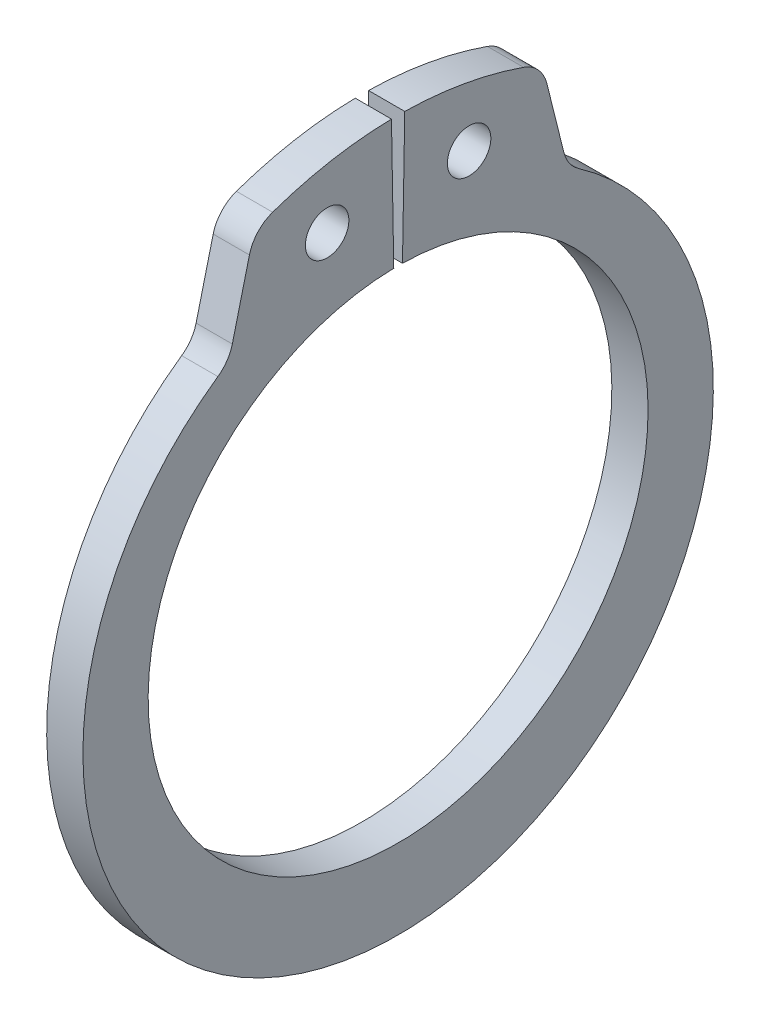
ISO-10303-21;
HEADER;
FILE_DESCRIPTION(('STEP AP214'),'2;1');
FILE_NAME('part.step','',(''),(''),'','','');
FILE_SCHEMA(('AUTOMOTIVE_DESIGN { 1 0 10303 214 1 1 1 1 }'));
ENDSEC;
DATA;
#1=APPLICATION_CONTEXT('core data for automotive mechanical design processes');
#2=APPLICATION_PROTOCOL_DEFINITION('international standard','automotive_design',2000,#1);
#3=PRODUCT_CONTEXT('',#1,'mechanical');
#4=PRODUCT('Part','Part','',(#3));
#5=PRODUCT_RELATED_PRODUCT_CATEGORY('part','',(#4));
#6=PRODUCT_DEFINITION_FORMATION('','',#4);
#7=PRODUCT_DEFINITION_CONTEXT('part definition',#1,'design');
#8=PRODUCT_DEFINITION('design','',#6,#7);
#9=PRODUCT_DEFINITION_SHAPE('','',#8);
#10=(LENGTH_UNIT() NAMED_UNIT(*) SI_UNIT(.MILLI.,.METRE.));
#11=(NAMED_UNIT(*) PLANE_ANGLE_UNIT() SI_UNIT($,.RADIAN.));
#12=(NAMED_UNIT(*) SI_UNIT($,.STERADIAN.) SOLID_ANGLE_UNIT());
#13=UNCERTAINTY_MEASURE_WITH_UNIT(LENGTH_MEASURE(1.E-05),#10,'distance_accuracy_value','');
#14=(GEOMETRIC_REPRESENTATION_CONTEXT(3) GLOBAL_UNCERTAINTY_ASSIGNED_CONTEXT((#13)) GLOBAL_UNIT_ASSIGNED_CONTEXT((#10,
#11,#12)) REPRESENTATION_CONTEXT('',''));
#15=CARTESIAN_POINT('',(0.,0.,0.));
#16=DIRECTION('',(0.,0.,1.));
#17=DIRECTION('',(1.,0.,0.));
#18=AXIS2_PLACEMENT_3D('',#15,#16,#17);
#19=CARTESIAN_POINT('',(0.5,0.,0.));
#20=DIRECTION('',(1.,0.,0.));
#21=DIRECTION('',(0.,0.,-1.));
#22=AXIS2_PLACEMENT_3D('',#19,#20,#21);
#23=PLANE('',#22);
#24=CARTESIAN_POINT('',(0.5,8.66711980549086,-1.9596288316201));
#25=DIRECTION('',(-1.,0.,0.));
#26=DIRECTION('',(0.,0.,1.));
#27=AXIS2_PLACEMENT_3D('',#24,#25,#26);
#28=CIRCLE('',#27,0.6);
#29=CARTESIAN_POINT('',(0.5,8.66711980549086,-1.3596288316201));
#30=VERTEX_POINT('',#29);
#31=EDGE_CURVE('E142',#30,#30,#28,.T.);
#32=ORIENTED_EDGE('',*,*,#31,.T.);
#33=EDGE_LOOP('',(#32));
#34=FACE_BOUND('',#33,.T.);
#35=CARTESIAN_POINT('',(0.5,0.,0.));
#36=DIRECTION('',(-1.,0.,0.));
#37=DIRECTION('',(0.,0.,1.));
#38=AXIS2_PLACEMENT_3D('',#35,#36,#37);
#39=CIRCLE('',#38,6.9);
#40=CARTESIAN_POINT('',(0.5,6.8989490965791,-0.120421604417256));
#41=VERTEX_POINT('',#40);
#42=CARTESIAN_POINT('',(0.5,6.8989490965791,0.120421604417256));
#43=VERTEX_POINT('',#42);
#44=EDGE_CURVE('E219',#41,#43,#39,.T.);
#45=ORIENTED_EDGE('',*,*,#44,.T.);
#46=DIRECTION('',(0.,-0.999847695156391,-0.0174524064372835));
#47=VECTOR('',#46,1.);
#48=CARTESIAN_POINT('',(0.5,6.8989490965791,0.120421604417256));
#49=LINE('',#48,#47);
#50=CARTESIAN_POINT('',(0.5,10.4984007991421,0.183250267591477));
#51=VERTEX_POINT('',#50);
#52=EDGE_CURVE('E157',#43,#51,#49,.F.);
#53=ORIENTED_EDGE('',*,*,#52,.T.);
#54=CARTESIAN_POINT('',(0.5,0.,0.));
#55=DIRECTION('',(-1.,0.,0.));
#56=DIRECTION('',(0.,0.,1.));
#57=AXIS2_PLACEMENT_3D('',#54,#55,#56);
#58=CIRCLE('',#57,10.5);
#59=CARTESIAN_POINT('',(0.5,9.91217887924345,3.46391539531209));
#60=VERTEX_POINT('',#59);
#61=EDGE_CURVE('E161',#60,#51,#58,.T.);
#62=ORIENTED_EDGE('',*,*,#61,.F.);
#63=CARTESIAN_POINT('',(0.5,8.96816184312502,3.13401869099666));
#64=DIRECTION('',(-1.,0.,0.));
#65=DIRECTION('',(0.,0.,1.));
#66=AXIS2_PLACEMENT_3D('',#63,#64,#65);
#67=CIRCLE('',#66,1.);
#68=CARTESIAN_POINT('',(0.5,9.21008373872469,4.10431441727265));
#69=VERTEX_POINT('',#68);
#70=EDGE_CURVE('E146',#69,#60,#67,.T.);
#71=ORIENTED_EDGE('',*,*,#70,.F.);
#72=DIRECTION('',(0.,0.970295726275997,-0.241921895599665));
#73=VECTOR('',#72,1.);
#74=CARTESIAN_POINT('',(0.5,9.71734472745919,3.97784004803122));
#75=LINE('',#74,#73);
#76=CARTESIAN_POINT('',(0.5,7.31761530924591,4.57615979123836));
#77=VERTEX_POINT('',#76);
#78=EDGE_CURVE('E140',#69,#77,#75,.F.);
#79=ORIENTED_EDGE('',*,*,#78,.T.);
#80=CARTESIAN_POINT('',(0.5,7.55953720484558,5.54645551751436));
#81=DIRECTION('',(-1.,0.,0.));
#82=DIRECTION('',(0.,0.,1.));
#83=AXIS2_PLACEMENT_3D('',#80,#81,#82);
#84=CIRCLE('',#83,1.);
#85=CARTESIAN_POINT('',(0.5,6.73911195964233,4.97470170945253));
#86=VERTEX_POINT('',#85);
#87=EDGE_CURVE('E130',#77,#86,#84,.T.);
#88=ORIENTED_EDGE('',*,*,#87,.T.);
#89=CARTESIAN_POINT('',(0.5,-0.399224177769538,0.));
#90=DIRECTION('',(-1.,0.,0.));
#91=DIRECTION('',(0.,0.,1.));
#92=AXIS2_PLACEMENT_3D('',#89,#90,#91);
#93=CIRCLE('',#92,8.70077582223046);
#94=CARTESIAN_POINT('',(0.5,6.73911195964233,-4.97470170945253));
#95=VERTEX_POINT('',#94);
#96=EDGE_CURVE('E233',#95,#86,#93,.T.);
#97=ORIENTED_EDGE('',*,*,#96,.F.);
#98=CARTESIAN_POINT('',(0.5,7.55953720484558,-5.54645551751436));
#99=DIRECTION('',(-1.,0.,0.));
#100=DIRECTION('',(0.,0.,1.));
#101=AXIS2_PLACEMENT_3D('',#98,#99,#100);
#102=CIRCLE('',#101,1.);
#103=CARTESIAN_POINT('',(0.5,7.31761530924591,-4.57615979123836));
#104=VERTEX_POINT('',#103);
#105=EDGE_CURVE('E229',#95,#104,#102,.T.);
#106=ORIENTED_EDGE('',*,*,#105,.T.);
#107=DIRECTION('',(0.,-0.970295726275997,-0.241921895599666));
#108=VECTOR('',#107,1.);
#109=CARTESIAN_POINT('',(0.5,9.71734472745919,-3.97784004803122));
#110=LINE('',#109,#108);
#111=CARTESIAN_POINT('',(0.5,9.21008373872469,-4.10431441727265));
#112=VERTEX_POINT('',#111);
#113=EDGE_CURVE('E169',#104,#112,#110,.F.);
#114=ORIENTED_EDGE('',*,*,#113,.T.);
#115=CARTESIAN_POINT('',(0.5,8.96816184312502,-3.13401869099666));
#116=DIRECTION('',(-1.,0.,0.));
#117=DIRECTION('',(0.,0.,1.));
#118=AXIS2_PLACEMENT_3D('',#115,#116,#117);
#119=CIRCLE('',#118,1.);
#120=CARTESIAN_POINT('',(0.5,9.91217887924345,-3.46391539531209));
#121=VERTEX_POINT('',#120);
#122=EDGE_CURVE('E172',#121,#112,#119,.T.);
#123=ORIENTED_EDGE('',*,*,#122,.F.);
#124=CARTESIAN_POINT('',(0.5,0.,0.));
#125=DIRECTION('',(-1.,0.,0.));
#126=DIRECTION('',(0.,0.,1.));
#127=AXIS2_PLACEMENT_3D('',#124,#125,#126);
#128=CIRCLE('',#127,10.5);
#129=CARTESIAN_POINT('',(0.5,10.4984007991421,-0.183250267591479));
#130=VERTEX_POINT('',#129);
#131=EDGE_CURVE('E222',#130,#121,#128,.T.);
#132=ORIENTED_EDGE('',*,*,#131,.F.);
#133=DIRECTION('',(0.,0.999847695156391,-0.0174524064372841));
#134=VECTOR('',#133,1.);
#135=CARTESIAN_POINT('',(0.5,10.4984007991421,-0.183250267591479));
#136=LINE('',#135,#134);
#137=EDGE_CURVE('E163',#130,#41,#136,.F.);
#138=ORIENTED_EDGE('',*,*,#137,.T.);
#139=EDGE_LOOP('',(#45,#53,#62,#71,#79,#88,#97,#106,#114,#123,#132,#138));
#140=FACE_BOUND('',#139,.T.);
#141=CARTESIAN_POINT('',(0.5,8.66711980549086,1.9596288316201));
#142=DIRECTION('',(-1.,0.,0.));
#143=DIRECTION('',(0.,0.,1.));
#144=AXIS2_PLACEMENT_3D('',#141,#142,#143);
#145=CIRCLE('',#144,0.6);
#146=CARTESIAN_POINT('',(0.5,8.66711980549086,2.5596288316201));
#147=VERTEX_POINT('',#146);
#148=EDGE_CURVE('E19',#147,#147,#145,.T.);
#149=ORIENTED_EDGE('',*,*,#148,.T.);
#150=EDGE_LOOP('',(#149));
#151=FACE_BOUND('',#150,.T.);
#152=ADVANCED_FACE('F16',(#34,#140,#151),#23,.T.);
#153=CARTESIAN_POINT('',(0.5,8.66711980549086,1.9596288316201));
#154=DIRECTION('',(-1.,0.,0.));
#155=DIRECTION('',(0.,0.,1.));
#156=AXIS2_PLACEMENT_3D('',#153,#154,#155);
#157=CYLINDRICAL_SURFACE('',#156,0.6);
#158=CARTESIAN_POINT('',(-0.5,8.66711980549086,1.9596288316201));
#159=DIRECTION('',(-1.,0.,0.));
#160=DIRECTION('',(0.,0.,1.));
#161=AXIS2_PLACEMENT_3D('',#158,#159,#160);
#162=CIRCLE('',#161,0.6);
#163=CARTESIAN_POINT('',(-0.5,8.66711980549086,2.5596288316201));
#164=VERTEX_POINT('',#163);
#165=EDGE_CURVE('E207',#164,#164,#162,.T.);
#166=ORIENTED_EDGE('',*,*,#165,.T.);
#167=EDGE_LOOP('',(#166));
#168=FACE_BOUND('',#167,.T.);
#169=ORIENTED_EDGE('',*,*,#148,.F.);
#170=EDGE_LOOP('',(#169));
#171=FACE_BOUND('',#170,.T.);
#172=ADVANCED_FACE('F296',(#168,#171),#157,.F.);
#173=CARTESIAN_POINT('',(0.5,7.55953720484558,5.54645551751436));
#174=DIRECTION('',(-1.,0.,0.));
#175=DIRECTION('',(0.,0.,1.));
#176=AXIS2_PLACEMENT_3D('',#173,#174,#175);
#177=CYLINDRICAL_SURFACE('',#176,1.);
#178=DIRECTION('',(1.,0.,0.));
#179=VECTOR('',#178,1.);
#180=CARTESIAN_POINT('',(0.5,7.31761530924591,4.57615979123836));
#181=LINE('',#180,#179);
#182=CARTESIAN_POINT('',(-0.5,7.31761530924591,4.57615979123836));
#183=VERTEX_POINT('',#182);
#184=EDGE_CURVE('E134',#77,#183,#181,.F.);
#185=ORIENTED_EDGE('',*,*,#184,.T.);
#186=CARTESIAN_POINT('',(-0.5,7.55953720484558,5.54645551751436));
#187=DIRECTION('',(-1.,0.,0.));
#188=DIRECTION('',(0.,0.,1.));
#189=AXIS2_PLACEMENT_3D('',#186,#187,#188);
#190=CIRCLE('',#189,1.);
#191=CARTESIAN_POINT('',(-0.5,6.73911195964233,4.97470170945253));
#192=VERTEX_POINT('',#191);
#193=EDGE_CURVE('E204',#183,#192,#190,.T.);
#194=ORIENTED_EDGE('',*,*,#193,.T.);
#195=DIRECTION('',(-1.,0.,0.));
#196=VECTOR('',#195,1.);
#197=CARTESIAN_POINT('',(0.5,6.73911195964233,4.97470170945253));
#198=LINE('',#197,#196);
#199=EDGE_CURVE('E135',#86,#192,#198,.T.);
#200=ORIENTED_EDGE('',*,*,#199,.F.);
#201=ORIENTED_EDGE('',*,*,#87,.F.);
#202=EDGE_LOOP('',(#185,#194,#200,#201));
#203=FACE_BOUND('',#202,.T.);
#204=ADVANCED_FACE('F132',(#203),#177,.F.);
#205=CARTESIAN_POINT('',(0.5,-0.399224177769538,0.));
#206=DIRECTION('',(-1.,0.,0.));
#207=DIRECTION('',(0.,0.,1.));
#208=AXIS2_PLACEMENT_3D('',#205,#206,#207);
#209=CYLINDRICAL_SURFACE('',#208,8.70077582223046);
#210=CARTESIAN_POINT('',(-0.5,-0.399224177769538,0.));
#211=DIRECTION('',(-1.,0.,0.));
#212=DIRECTION('',(0.,0.,1.));
#213=AXIS2_PLACEMENT_3D('',#210,#211,#212);
#214=CIRCLE('',#213,8.70077582223046);
#215=CARTESIAN_POINT('',(-0.5,6.73911195964233,-4.97470170945253));
#216=VERTEX_POINT('',#215);
#217=EDGE_CURVE('E201',#192,#216,#214,.F.);
#218=ORIENTED_EDGE('',*,*,#217,.T.);
#219=DIRECTION('',(-1.,0.,0.));
#220=VECTOR('',#219,1.);
#221=CARTESIAN_POINT('',(0.5,6.73911195964233,-4.97470170945253));
#222=LINE('',#221,#220);
#223=EDGE_CURVE('E232',#216,#95,#222,.F.);
#224=ORIENTED_EDGE('',*,*,#223,.T.);
#225=ORIENTED_EDGE('',*,*,#96,.T.);
#226=ORIENTED_EDGE('',*,*,#199,.T.);
#227=EDGE_LOOP('',(#218,#224,#225,#226));
#228=FACE_BOUND('',#227,.T.);
#229=ADVANCED_FACE('F240',(#228),#209,.T.);
#230=CARTESIAN_POINT('',(0.5,7.55953720484558,-5.54645551751436));
#231=DIRECTION('',(-1.,0.,0.));
#232=DIRECTION('',(0.,0.,1.));
#233=AXIS2_PLACEMENT_3D('',#230,#231,#232);
#234=CYLINDRICAL_SURFACE('',#233,1.);
#235=ORIENTED_EDGE('',*,*,#223,.F.);
#236=CARTESIAN_POINT('',(-0.5,7.55953720484558,-5.54645551751436));
#237=DIRECTION('',(-1.,0.,0.));
#238=DIRECTION('',(0.,0.,1.));
#239=AXIS2_PLACEMENT_3D('',#236,#237,#238);
#240=CIRCLE('',#239,1.);
#241=CARTESIAN_POINT('',(-0.5,7.31761530924591,-4.57615979123836));
#242=VERTEX_POINT('',#241);
#243=EDGE_CURVE('E197',#216,#242,#240,.T.);
#244=ORIENTED_EDGE('',*,*,#243,.T.);
#245=DIRECTION('',(1.,0.,0.));
#246=VECTOR('',#245,1.);
#247=CARTESIAN_POINT('',(0.5,7.31761530924591,-4.57615979123836));
#248=LINE('',#247,#246);
#249=EDGE_CURVE('E173',#242,#104,#248,.T.);
#250=ORIENTED_EDGE('',*,*,#249,.T.);
#251=ORIENTED_EDGE('',*,*,#105,.F.);
#252=EDGE_LOOP('',(#235,#244,#250,#251));
#253=FACE_BOUND('',#252,.T.);
#254=ADVANCED_FACE('F252',(#253),#234,.F.);
#255=CARTESIAN_POINT('',(0.5,9.71734472745919,-3.97784004803122));
#256=DIRECTION('',(0.,-0.241921895599666,0.970295726275997));
#257=DIRECTION('',(0.,-0.970295726275997,-0.241921895599666));
#258=AXIS2_PLACEMENT_3D('',#255,#256,#257);
#259=PLANE('',#258);
#260=DIRECTION('',(-1.,0.,0.));
#261=VECTOR('',#260,1.);
#262=CARTESIAN_POINT('',(0.5,9.21008373872469,-4.10431441727265));
#263=LINE('',#262,#261);
#264=CARTESIAN_POINT('',(-0.5,9.21008373872469,-4.10431441727265));
#265=VERTEX_POINT('',#264);
#266=EDGE_CURVE('E226',#112,#265,#263,.T.);
#267=ORIENTED_EDGE('',*,*,#266,.F.);
#268=ORIENTED_EDGE('',*,*,#113,.F.);
#269=ORIENTED_EDGE('',*,*,#249,.F.);
#270=DIRECTION('',(0.,0.970295726275997,0.241921895599666));
#271=VECTOR('',#270,1.);
#272=CARTESIAN_POINT('',(-0.5,7.31761530924591,-4.57615979123836));
#273=LINE('',#272,#271);
#274=EDGE_CURVE('E196',#242,#265,#273,.T.);
#275=ORIENTED_EDGE('',*,*,#274,.T.);
#276=EDGE_LOOP('',(#267,#268,#269,#275));
#277=FACE_BOUND('',#276,.T.);
#278=ADVANCED_FACE('F258',(#277),#259,.F.);
#279=CARTESIAN_POINT('',(0.5,8.96816184312502,-3.13401869099666));
#280=DIRECTION('',(-1.,0.,0.));
#281=DIRECTION('',(0.,0.,1.));
#282=AXIS2_PLACEMENT_3D('',#279,#280,#281);
#283=CYLINDRICAL_SURFACE('',#282,1.);
#284=CARTESIAN_POINT('',(-0.5,8.96816184312502,-3.13401869099666));
#285=DIRECTION('',(-1.,0.,0.));
#286=DIRECTION('',(0.,0.,1.));
#287=AXIS2_PLACEMENT_3D('',#284,#285,#286);
#288=CIRCLE('',#287,1.);
#289=CARTESIAN_POINT('',(-0.5,9.91217887924345,-3.46391539531209));
#290=VERTEX_POINT('',#289);
#291=EDGE_CURVE('E192',#265,#290,#288,.F.);
#292=ORIENTED_EDGE('',*,*,#291,.T.);
#293=DIRECTION('',(-1.,0.,0.));
#294=VECTOR('',#293,1.);
#295=CARTESIAN_POINT('',(0.5,9.91217887924345,-3.46391539531209));
#296=LINE('',#295,#294);
#297=EDGE_CURVE('E225',#121,#290,#296,.T.);
#298=ORIENTED_EDGE('',*,*,#297,.F.);
#299=ORIENTED_EDGE('',*,*,#122,.T.);
#300=ORIENTED_EDGE('',*,*,#266,.T.);
#301=EDGE_LOOP('',(#292,#298,#299,#300));
#302=FACE_BOUND('',#301,.T.);
#303=ADVANCED_FACE('F342',(#302),#283,.T.);
#304=CARTESIAN_POINT('',(0.5,0.,0.));
#305=DIRECTION('',(-1.,0.,0.));
#306=DIRECTION('',(0.,0.,1.));
#307=AXIS2_PLACEMENT_3D('',#304,#305,#306);
#308=CYLINDRICAL_SURFACE('',#307,10.5);
#309=CARTESIAN_POINT('',(-0.5,0.,0.));
#310=DIRECTION('',(-1.,0.,0.));
#311=DIRECTION('',(0.,0.,1.));
#312=AXIS2_PLACEMENT_3D('',#309,#310,#311);
#313=CIRCLE('',#312,10.5);
#314=CARTESIAN_POINT('',(-0.5,10.4984007991421,-0.183250267591479));
#315=VERTEX_POINT('',#314);
#316=EDGE_CURVE('E188',#290,#315,#313,.F.);
#317=ORIENTED_EDGE('',*,*,#316,.T.);
#318=DIRECTION('',(1.,0.,0.));
#319=VECTOR('',#318,1.);
#320=CARTESIAN_POINT('',(0.5,10.4984007991421,-0.183250267591479));
#321=LINE('',#320,#319);
#322=EDGE_CURVE('E168',#315,#130,#321,.T.);
#323=ORIENTED_EDGE('',*,*,#322,.T.);
#324=ORIENTED_EDGE('',*,*,#131,.T.);
#325=ORIENTED_EDGE('',*,*,#297,.T.);
#326=EDGE_LOOP('',(#317,#323,#324,#325));
#327=FACE_BOUND('',#326,.T.);
#328=ADVANCED_FACE('F338',(#327),#308,.T.);
#329=CARTESIAN_POINT('',(0.5,10.4984007991421,-0.183250267591479));
#330=DIRECTION('',(0.,-0.0174524064372841,-0.999847695156391));
#331=DIRECTION('',(0.,0.999847695156391,-0.0174524064372841));
#332=AXIS2_PLACEMENT_3D('',#329,#330,#331);
#333=PLANE('',#332);
#334=DIRECTION('',(-1.,0.,0.));
#335=VECTOR('',#334,1.);
#336=CARTESIAN_POINT('',(0.5,6.8989490965791,-0.120421604417256));
#337=LINE('',#336,#335);
#338=CARTESIAN_POINT('',(-0.5,6.8989490965791,-0.120421604417256));
#339=VERTEX_POINT('',#338);
#340=EDGE_CURVE('E167',#339,#41,#337,.F.);
#341=ORIENTED_EDGE('',*,*,#340,.T.);
#342=ORIENTED_EDGE('',*,*,#137,.F.);
#343=ORIENTED_EDGE('',*,*,#322,.F.);
#344=DIRECTION('',(0.,-0.999847695156391,0.017452406437284));
#345=VECTOR('',#344,1.);
#346=CARTESIAN_POINT('',(-0.5,10.4984007991421,-0.183250267591479));
#347=LINE('',#346,#345);
#348=EDGE_CURVE('E187',#315,#339,#347,.T.);
#349=ORIENTED_EDGE('',*,*,#348,.T.);
#350=EDGE_LOOP('',(#341,#342,#343,#349));
#351=FACE_BOUND('',#350,.T.);
#352=ADVANCED_FACE('F334',(#351),#333,.F.);
#353=CARTESIAN_POINT('',(0.5,0.,0.));
#354=DIRECTION('',(-1.,0.,0.));
#355=DIRECTION('',(0.,0.,1.));
#356=AXIS2_PLACEMENT_3D('',#353,#354,#355);
#357=CYLINDRICAL_SURFACE('',#356,6.9);
#358=ORIENTED_EDGE('',*,*,#44,.F.);
#359=ORIENTED_EDGE('',*,*,#340,.F.);
#360=CARTESIAN_POINT('',(-0.5,0.,0.));
#361=DIRECTION('',(-1.,0.,0.));
#362=DIRECTION('',(0.,0.,1.));
#363=AXIS2_PLACEMENT_3D('',#360,#361,#362);
#364=CIRCLE('',#363,6.9);
#365=CARTESIAN_POINT('',(-0.5,6.8989490965791,0.120421604417256));
#366=VERTEX_POINT('',#365);
#367=EDGE_CURVE('E184',#339,#366,#364,.T.);
#368=ORIENTED_EDGE('',*,*,#367,.T.);
#369=DIRECTION('',(1.,0.,0.));
#370=VECTOR('',#369,1.);
#371=CARTESIAN_POINT('',(0.5,6.8989490965791,0.120421604417256));
#372=LINE('',#371,#370);
#373=EDGE_CURVE('E162',#366,#43,#372,.T.);
#374=ORIENTED_EDGE('',*,*,#373,.T.);
#375=EDGE_LOOP('',(#358,#359,#368,#374));
#376=FACE_BOUND('',#375,.T.);
#377=ADVANCED_FACE('F330',(#376),#357,.F.);
#378=CARTESIAN_POINT('',(0.5,6.8989490965791,0.120421604417256));
#379=DIRECTION('',(0.,-0.0174524064372835,0.999847695156391));
#380=DIRECTION('',(0.,-0.999847695156391,-0.0174524064372835));
#381=AXIS2_PLACEMENT_3D('',#378,#379,#380);
#382=PLANE('',#381);
#383=DIRECTION('',(-1.,0.,0.));
#384=VECTOR('',#383,1.);
#385=CARTESIAN_POINT('',(0.5,10.4984007991421,0.183250267591476));
#386=LINE('',#385,#384);
#387=CARTESIAN_POINT('',(-0.5,10.4984007991421,0.183250267591477));
#388=VERTEX_POINT('',#387);
#389=EDGE_CURVE('E216',#51,#388,#386,.T.);
#390=ORIENTED_EDGE('',*,*,#389,.F.);
#391=ORIENTED_EDGE('',*,*,#52,.F.);
#392=ORIENTED_EDGE('',*,*,#373,.F.);
#393=DIRECTION('',(0.,0.999847695156391,0.0174524064372835));
#394=VECTOR('',#393,1.);
#395=CARTESIAN_POINT('',(-0.5,6.8989490965791,0.120421604417256));
#396=LINE('',#395,#394);
#397=EDGE_CURVE('E183',#366,#388,#396,.T.);
#398=ORIENTED_EDGE('',*,*,#397,.T.);
#399=EDGE_LOOP('',(#390,#391,#392,#398));
#400=FACE_BOUND('',#399,.T.);
#401=ADVANCED_FACE('F326',(#400),#382,.F.);
#402=CARTESIAN_POINT('',(0.5,0.,0.));
#403=DIRECTION('',(-1.,0.,0.));
#404=DIRECTION('',(0.,0.,1.));
#405=AXIS2_PLACEMENT_3D('',#402,#403,#404);
#406=CYLINDRICAL_SURFACE('',#405,10.5);
#407=ORIENTED_EDGE('',*,*,#61,.T.);
#408=ORIENTED_EDGE('',*,*,#389,.T.);
#409=CARTESIAN_POINT('',(-0.5,0.,0.));
#410=DIRECTION('',(-1.,0.,0.));
#411=DIRECTION('',(0.,0.,1.));
#412=AXIS2_PLACEMENT_3D('',#409,#410,#411);
#413=CIRCLE('',#412,10.5);
#414=CARTESIAN_POINT('',(-0.5,9.91217887924345,3.46391539531209));
#415=VERTEX_POINT('',#414);
#416=EDGE_CURVE('E179',#388,#415,#413,.F.);
#417=ORIENTED_EDGE('',*,*,#416,.T.);
#418=DIRECTION('',(-1.,0.,0.));
#419=VECTOR('',#418,1.);
#420=CARTESIAN_POINT('',(0.5,9.91217887924345,3.46391539531209));
#421=LINE('',#420,#419);
#422=EDGE_CURVE('E152',#60,#415,#421,.T.);
#423=ORIENTED_EDGE('',*,*,#422,.F.);
#424=EDGE_LOOP('',(#407,#408,#417,#423));
#425=FACE_BOUND('',#424,.T.);
#426=ADVANCED_FACE('F322',(#425),#406,.T.);
#427=CARTESIAN_POINT('',(0.5,8.96816184312502,3.13401869099666));
#428=DIRECTION('',(-1.,0.,0.));
#429=DIRECTION('',(0.,0.,1.));
#430=AXIS2_PLACEMENT_3D('',#427,#428,#429);
#431=CYLINDRICAL_SURFACE('',#430,1.);
#432=CARTESIAN_POINT('',(-0.5,8.96816184312502,3.13401869099666));
#433=DIRECTION('',(-1.,0.,0.));
#434=DIRECTION('',(0.,0.,1.));
#435=AXIS2_PLACEMENT_3D('',#432,#433,#434);
#436=CIRCLE('',#435,1.);
#437=CARTESIAN_POINT('',(-0.5,9.21008373872469,4.10431441727265));
#438=VERTEX_POINT('',#437);
#439=EDGE_CURVE('E175',#415,#438,#436,.F.);
#440=ORIENTED_EDGE('',*,*,#439,.T.);
#441=DIRECTION('',(1.,0.,0.));
#442=VECTOR('',#441,1.);
#443=CARTESIAN_POINT('',(0.5,9.21008373872469,4.10431441727265));
#444=LINE('',#443,#442);
#445=EDGE_CURVE('E39',#438,#69,#444,.T.);
#446=ORIENTED_EDGE('',*,*,#445,.T.);
#447=ORIENTED_EDGE('',*,*,#70,.T.);
#448=ORIENTED_EDGE('',*,*,#422,.T.);
#449=EDGE_LOOP('',(#440,#446,#447,#448));
#450=FACE_BOUND('',#449,.T.);
#451=ADVANCED_FACE('F319',(#450),#431,.T.);
#452=CARTESIAN_POINT('',(0.5,9.71734472745919,3.97784004803122));
#453=DIRECTION('',(0.,-0.241921895599665,-0.970295726275997));
#454=DIRECTION('',(0.,0.970295726275997,-0.241921895599665));
#455=AXIS2_PLACEMENT_3D('',#452,#453,#454);
#456=PLANE('',#455);
#457=ORIENTED_EDGE('',*,*,#184,.F.);
#458=ORIENTED_EDGE('',*,*,#78,.F.);
#459=ORIENTED_EDGE('',*,*,#445,.F.);
#460=DIRECTION('',(0.,-0.970295726275997,0.241921895599665));
#461=VECTOR('',#460,1.);
#462=CARTESIAN_POINT('',(-0.5,9.21008373872469,4.10431441727265));
#463=LINE('',#462,#461);
#464=EDGE_CURVE('E26',#438,#183,#463,.T.);
#465=ORIENTED_EDGE('',*,*,#464,.T.);
#466=EDGE_LOOP('',(#457,#458,#459,#465));
#467=FACE_BOUND('',#466,.T.);
#468=ADVANCED_FACE('F139',(#467),#456,.F.);
#469=CARTESIAN_POINT('',(0.5,8.66711980549086,-1.9596288316201));
#470=DIRECTION('',(-1.,0.,0.));
#471=DIRECTION('',(0.,0.,1.));
#472=AXIS2_PLACEMENT_3D('',#469,#470,#471);
#473=CYLINDRICAL_SURFACE('',#472,0.6);
#474=CARTESIAN_POINT('',(-0.5,8.66711980549086,-1.9596288316201));
#475=DIRECTION('',(-1.,0.,0.));
#476=DIRECTION('',(0.,0.,1.));
#477=AXIS2_PLACEMENT_3D('',#474,#475,#476);
#478=CIRCLE('',#477,0.6);
#479=CARTESIAN_POINT('',(-0.5,8.66711980549086,-1.3596288316201));
#480=VERTEX_POINT('',#479);
#481=EDGE_CURVE('E11',#480,#480,#478,.T.);
#482=ORIENTED_EDGE('',*,*,#481,.T.);
#483=EDGE_LOOP('',(#482));
#484=FACE_BOUND('',#483,.T.);
#485=ORIENTED_EDGE('',*,*,#31,.F.);
#486=EDGE_LOOP('',(#485));
#487=FACE_BOUND('',#486,.T.);
#488=ADVANCED_FACE('F307',(#484,#487),#473,.F.);
#489=CARTESIAN_POINT('',(-0.5,0.,0.));
#490=DIRECTION('',(1.,0.,0.));
#491=DIRECTION('',(0.,0.,-1.));
#492=AXIS2_PLACEMENT_3D('',#489,#490,#491);
#493=PLANE('',#492);
#494=ORIENTED_EDGE('',*,*,#481,.F.);
#495=EDGE_LOOP('',(#494));
#496=FACE_BOUND('',#495,.T.);
#497=ORIENTED_EDGE('',*,*,#439,.F.);
#498=ORIENTED_EDGE('',*,*,#416,.F.);
#499=ORIENTED_EDGE('',*,*,#397,.F.);
#500=ORIENTED_EDGE('',*,*,#367,.F.);
#501=ORIENTED_EDGE('',*,*,#348,.F.);
#502=ORIENTED_EDGE('',*,*,#316,.F.);
#503=ORIENTED_EDGE('',*,*,#291,.F.);
#504=ORIENTED_EDGE('',*,*,#274,.F.);
#505=ORIENTED_EDGE('',*,*,#243,.F.);
#506=ORIENTED_EDGE('',*,*,#217,.F.);
#507=ORIENTED_EDGE('',*,*,#193,.F.);
#508=ORIENTED_EDGE('',*,*,#464,.F.);
#509=EDGE_LOOP('',(#497,#498,#499,#500,#501,#502,#503,#504,#505,#506,#507,#508));
#510=FACE_BOUND('',#509,.T.);
#511=ORIENTED_EDGE('',*,*,#165,.F.);
#512=EDGE_LOOP('',(#511));
#513=FACE_BOUND('',#512,.T.);
#514=ADVANCED_FACE('F245',(#496,#510,#513),#493,.F.);
#515=CLOSED_SHELL('',(#152,#172,#204,#229,#254,#278,#303,#328,#352,#377,#401,#426,#451,#468,
#488,#514));
#516=MANIFOLD_SOLID_BREP('B1',#515);
#517=ADVANCED_BREP_SHAPE_REPRESENTATION('',(#18,#516),#14);
#518=SHAPE_DEFINITION_REPRESENTATION(#9,#517);
ENDSEC;
END-ISO-10303-21;
